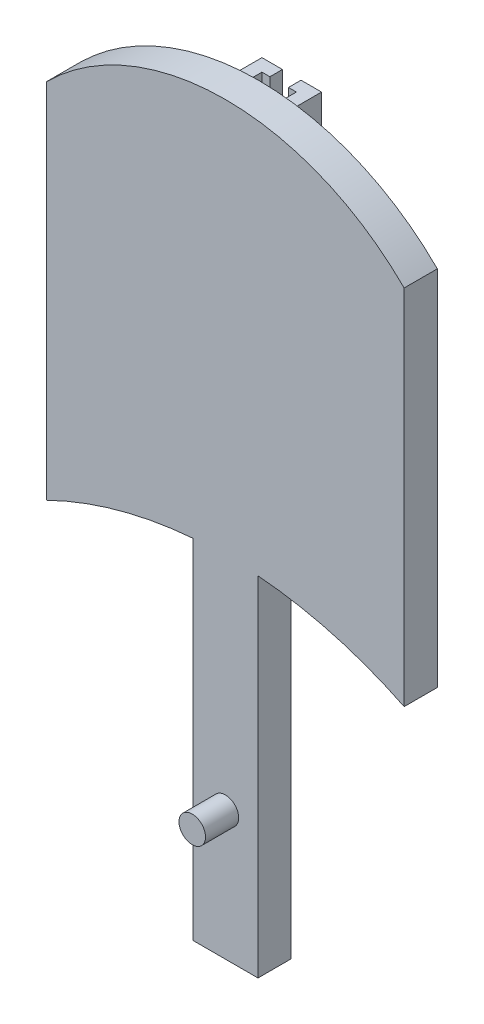
ISO-10303-21;
HEADER;
FILE_DESCRIPTION(('STEP AP214'),'2;1');
FILE_NAME('part.step','',(''),(''),'','','');
FILE_SCHEMA(('AUTOMOTIVE_DESIGN { 1 0 10303 214 1 1 1 1 }'));
ENDSEC;
DATA;
#1=APPLICATION_CONTEXT('core data for automotive mechanical design processes');
#2=APPLICATION_PROTOCOL_DEFINITION('international standard','automotive_design',2000,#1);
#3=PRODUCT_CONTEXT('',#1,'mechanical');
#4=PRODUCT('Part','Part','',(#3));
#5=PRODUCT_RELATED_PRODUCT_CATEGORY('part','',(#4));
#6=PRODUCT_DEFINITION_FORMATION('','',#4);
#7=PRODUCT_DEFINITION_CONTEXT('part definition',#1,'design');
#8=PRODUCT_DEFINITION('design','',#6,#7);
#9=PRODUCT_DEFINITION_SHAPE('','',#8);
#10=(LENGTH_UNIT() NAMED_UNIT(*) SI_UNIT(.MILLI.,.METRE.));
#11=(NAMED_UNIT(*) PLANE_ANGLE_UNIT() SI_UNIT($,.RADIAN.));
#12=(NAMED_UNIT(*) SI_UNIT($,.STERADIAN.) SOLID_ANGLE_UNIT());
#13=UNCERTAINTY_MEASURE_WITH_UNIT(LENGTH_MEASURE(1.E-05),#10,'distance_accuracy_value','');
#14=(GEOMETRIC_REPRESENTATION_CONTEXT(3) GLOBAL_UNCERTAINTY_ASSIGNED_CONTEXT((#13)) GLOBAL_UNIT_ASSIGNED_CONTEXT((#10,
#11,#12)) REPRESENTATION_CONTEXT('',''));
#15=CARTESIAN_POINT('',(0.,0.,0.));
#16=DIRECTION('',(0.,0.,1.));
#17=DIRECTION('',(1.,0.,0.));
#18=AXIS2_PLACEMENT_3D('',#15,#16,#17);
#19=CARTESIAN_POINT('',(0.,23.2983529403055,-3.175));
#20=DIRECTION('',(0.,1.,0.));
#21=DIRECTION('',(0.,0.,1.));
#22=AXIS2_PLACEMENT_3D('',#19,#20,#21);
#23=PLANE('',#22);
#24=DIRECTION('',(0.,0.,-1.));
#25=VECTOR('',#24,1.);
#26=CARTESIAN_POINT('',(0.888999999999995,23.2983529403055,6.351));
#27=LINE('',#26,#25);
#28=CARTESIAN_POINT('',(0.888999999999995,23.2983529403055,-1.972861942));
#29=VERTEX_POINT('',#28);
#30=CARTESIAN_POINT('',(0.888999999999995,23.2983529403055,-3.175));
#31=VERTEX_POINT('',#30);
#32=EDGE_CURVE('E452',#29,#31,#27,.T.);
#33=ORIENTED_EDGE('',*,*,#32,.F.);
#34=DIRECTION('',(1.,0.,0.));
#35=VECTOR('',#34,1.);
#36=CARTESIAN_POINT('',(-17.1162533328683,23.2983529403055,-1.972861942));
#37=LINE('',#36,#35);
#38=CARTESIAN_POINT('',(1.65128861988301,23.2983529403055,-1.972861942));
#39=VERTEX_POINT('',#38);
#40=EDGE_CURVE('E216',#29,#39,#37,.T.);
#41=ORIENTED_EDGE('',*,*,#40,.T.);
#42=DIRECTION('',(0.,0.,1.));
#43=VECTOR('',#42,1.);
#44=CARTESIAN_POINT('',(1.65128861988301,23.2983529403055,-3.175));
#45=LINE('',#44,#43);
#46=CARTESIAN_POINT('',(1.65128861988301,23.2983529403055,0.));
#47=VERTEX_POINT('',#46);
#48=EDGE_CURVE('E312',#39,#47,#45,.T.);
#49=ORIENTED_EDGE('',*,*,#48,.T.);
#50=DIRECTION('',(-1.,0.,0.));
#51=VECTOR('',#50,1.);
#52=CARTESIAN_POINT('',(0.,23.2983529403055,0.));
#53=LINE('',#52,#51);
#54=CARTESIAN_POINT('',(2.85342673515783,23.2983529403055,0.));
#55=VERTEX_POINT('',#54);
#56=EDGE_CURVE('E292',#55,#47,#53,.T.);
#57=ORIENTED_EDGE('',*,*,#56,.F.);
#58=DIRECTION('',(0.,0.,1.));
#59=VECTOR('',#58,1.);
#60=CARTESIAN_POINT('',(2.85342673515783,23.2983529403055,-3.175));
#61=LINE('',#60,#59);
#62=CARTESIAN_POINT('',(2.85342673515783,23.2983529403055,-3.175));
#63=VERTEX_POINT('',#62);
#64=EDGE_CURVE('E308',#63,#55,#61,.T.);
#65=ORIENTED_EDGE('',*,*,#64,.F.);
#66=DIRECTION('',(-1.,0.,0.));
#67=VECTOR('',#66,1.);
#68=CARTESIAN_POINT('',(0.,23.2983529403055,-3.175));
#69=LINE('',#68,#67);
#70=EDGE_CURVE('E274',#63,#31,#69,.T.);
#71=ORIENTED_EDGE('',*,*,#70,.T.);
#72=EDGE_LOOP('',(#33,#41,#49,#57,#65,#71));
#73=FACE_BOUND('',#72,.T.);
#74=ADVANCED_FACE('F47',(#73),#23,.T.);
#75=CARTESIAN_POINT('',(0.,0.,-3.175));
#76=DIRECTION('',(0.,0.,-1.));
#77=DIRECTION('',(-1.,0.,0.));
#78=AXIS2_PLACEMENT_3D('',#75,#76,#77);
#79=PLANE('',#78);
#80=DIRECTION('',(0.,-1.,0.));
#81=VECTOR('',#80,1.);
#82=CARTESIAN_POINT('',(0.888999999999995,-13.4179283025949,-3.175));
#83=LINE('',#82,#81);
#84=CARTESIAN_POINT('',(0.888999999999987,-13.4179283025949,-3.175));
#85=VERTEX_POINT('',#84);
#86=EDGE_CURVE('E71',#31,#85,#83,.T.);
#87=ORIENTED_EDGE('',*,*,#86,.F.);
#88=ORIENTED_EDGE('',*,*,#70,.F.);
#89=DIRECTION('',(0.,1.,0.));
#90=VECTOR('',#89,1.);
#91=CARTESIAN_POINT('',(2.85342673515783,0.,-3.175));
#92=LINE('',#91,#90);
#93=CARTESIAN_POINT('',(2.85342673515783,-13.4877816695383,-3.175));
#94=VERTEX_POINT('',#93);
#95=EDGE_CURVE('E278',#94,#63,#92,.T.);
#96=ORIENTED_EDGE('',*,*,#95,.F.);
#97=CARTESIAN_POINT('',(0.,-52.2146947063219,-3.175));
#98=DIRECTION('',(0.,0.,-1.));
#99=DIRECTION('',(-1.,0.,0.));
#100=AXIS2_PLACEMENT_3D('',#97,#98,#99);
#101=CIRCLE('',#100,38.8318920153463);
#102=CARTESIAN_POINT('',(1.65128861988301,-13.4179283025949,-3.175));
#103=VERTEX_POINT('',#102);
#104=EDGE_CURVE('E283',#94,#103,#101,.F.);
#105=ORIENTED_EDGE('',*,*,#104,.T.);
#106=DIRECTION('',(1.,0.,0.));
#107=VECTOR('',#106,1.);
#108=CARTESIAN_POINT('',(-17.1162533328683,-13.4179283025949,-3.175));
#109=LINE('',#108,#107);
#110=EDGE_CURVE('E446',#85,#103,#109,.T.);
#111=ORIENTED_EDGE('',*,*,#110,.F.);
#112=EDGE_LOOP('',(#87,#88,#96,#105,#111));
#113=FACE_BOUND('',#112,.T.);
#114=ADVANCED_FACE('F451',(#113),#79,.T.);
#115=CARTESIAN_POINT('',(-17.1162533328683,23.2983529403055,-1.972861942));
#116=DIRECTION('',(0.,0.,-1.));
#117=DIRECTION('',(-1.,0.,0.));
#118=AXIS2_PLACEMENT_3D('',#115,#116,#117);
#119=PLANE('',#118);
#120=ORIENTED_EDGE('',*,*,#40,.F.);
#121=DIRECTION('',(0.,1.,0.));
#122=VECTOR('',#121,1.);
#123=CARTESIAN_POINT('',(0.888999999999995,-13.4179283025949,-1.972861942));
#124=LINE('',#123,#122);
#125=CARTESIAN_POINT('',(0.888999999999995,-13.4179283025949,-1.972861942));
#126=VERTEX_POINT('',#125);
#127=EDGE_CURVE('E208',#126,#29,#124,.T.);
#128=ORIENTED_EDGE('',*,*,#127,.F.);
#129=DIRECTION('',(1.,0.,0.));
#130=VECTOR('',#129,1.);
#131=CARTESIAN_POINT('',(-17.1162533328683,-13.4179283025949,-1.972861942));
#132=LINE('',#131,#130);
#133=CARTESIAN_POINT('',(1.65128861988301,-13.4179283025949,-1.972861942));
#134=VERTEX_POINT('',#133);
#135=EDGE_CURVE('E444',#126,#134,#132,.T.);
#136=ORIENTED_EDGE('',*,*,#135,.T.);
#137=DIRECTION('',(0.,1.,0.));
#138=VECTOR('',#137,1.);
#139=CARTESIAN_POINT('',(1.65128861988301,23.2983529403055,-1.972861942));
#140=LINE('',#139,#138);
#141=EDGE_CURVE('E215',#134,#39,#140,.T.);
#142=ORIENTED_EDGE('',*,*,#141,.T.);
#143=EDGE_LOOP('',(#120,#128,#136,#142));
#144=FACE_BOUND('',#143,.T.);
#145=ADVANCED_FACE('F457',(#144),#119,.F.);
#146=CARTESIAN_POINT('',(-17.1162533328683,-13.4179283025949,-1.972861942));
#147=DIRECTION('',(0.,1.,0.));
#148=DIRECTION('',(0.,0.,1.));
#149=AXIS2_PLACEMENT_3D('',#146,#147,#148);
#150=PLANE('',#149);
#151=ORIENTED_EDGE('',*,*,#135,.F.);
#152=DIRECTION('',(0.,0.,-1.));
#153=VECTOR('',#152,1.);
#154=CARTESIAN_POINT('',(0.888999999999995,-13.4179283025949,6.351));
#155=LINE('',#154,#153);
#156=EDGE_CURVE('E447',#126,#85,#155,.T.);
#157=ORIENTED_EDGE('',*,*,#156,.T.);
#158=ORIENTED_EDGE('',*,*,#110,.T.);
#159=DIRECTION('',(0.,0.,1.));
#160=VECTOR('',#159,1.);
#161=CARTESIAN_POINT('',(1.65128861988301,-13.4179283025949,-3.175));
#162=LINE('',#161,#160);
#163=EDGE_CURVE('E300',#103,#134,#162,.T.);
#164=ORIENTED_EDGE('',*,*,#163,.T.);
#165=EDGE_LOOP('',(#151,#157,#158,#164));
#166=FACE_BOUND('',#165,.T.);
#167=ADVANCED_FACE('F443',(#166),#150,.F.);
#168=CARTESIAN_POINT('',(-1.65128861988301,0.,-3.175));
#169=DIRECTION('',(1.,0.,0.));
#170=DIRECTION('',(0.,0.,-1.));
#171=AXIS2_PLACEMENT_3D('',#168,#169,#170);
#172=PLANE('',#171);
#173=DIRECTION('',(0.,0.,1.));
#174=VECTOR('',#173,1.);
#175=CARTESIAN_POINT('',(-1.65128861988301,-13.4179283025949,-3.175));
#176=LINE('',#175,#174);
#177=CARTESIAN_POINT('',(-1.65128861988301,-13.4179283025949,-1.972861942));
#178=VERTEX_POINT('',#177);
#179=CARTESIAN_POINT('',(-1.65128861988301,-13.4179283025949,0.));
#180=VERTEX_POINT('',#179);
#181=EDGE_CURVE('E325',#178,#180,#176,.T.);
#182=ORIENTED_EDGE('',*,*,#181,.F.);
#183=DIRECTION('',(0.,-1.,0.));
#184=VECTOR('',#183,1.);
#185=CARTESIAN_POINT('',(-1.65128861988301,23.2983529403055,-1.972861942));
#186=LINE('',#185,#184);
#187=CARTESIAN_POINT('',(-1.65128861988301,23.2983529403055,-1.972861942));
#188=VERTEX_POINT('',#187);
#189=EDGE_CURVE('E196',#188,#178,#186,.T.);
#190=ORIENTED_EDGE('',*,*,#189,.F.);
#191=DIRECTION('',(0.,0.,1.));
#192=VECTOR('',#191,1.);
#193=CARTESIAN_POINT('',(-1.65128861988301,23.2983529403055,-3.175));
#194=LINE('',#193,#192);
#195=CARTESIAN_POINT('',(-1.65128861988301,23.2983529403055,0.));
#196=VERTEX_POINT('',#195);
#197=EDGE_CURVE('E213',#188,#196,#194,.T.);
#198=ORIENTED_EDGE('',*,*,#197,.T.);
#199=DIRECTION('',(0.,1.,0.));
#200=VECTOR('',#199,1.);
#201=CARTESIAN_POINT('',(-1.65128861988301,0.,0.));
#202=LINE('',#201,#200);
#203=EDGE_CURVE('E321',#180,#196,#202,.T.);
#204=ORIENTED_EDGE('',*,*,#203,.F.);
#205=EDGE_LOOP('',(#182,#190,#198,#204));
#206=FACE_BOUND('',#205,.T.);
#207=ADVANCED_FACE('F514',(#206),#172,.T.);
#208=CARTESIAN_POINT('',(1.65128861988301,0.,-3.175));
#209=DIRECTION('',(1.,0.,0.));
#210=DIRECTION('',(0.,0.,-1.));
#211=AXIS2_PLACEMENT_3D('',#208,#209,#210);
#212=PLANE('',#211);
#213=ORIENTED_EDGE('',*,*,#141,.F.);
#214=CARTESIAN_POINT('',(1.65128861988301,-13.4179283025949,0.));
#215=VERTEX_POINT('',#214);
#216=EDGE_CURVE('E287',#134,#215,#162,.T.);
#217=ORIENTED_EDGE('',*,*,#216,.T.);
#218=DIRECTION('',(0.,1.,0.));
#219=VECTOR('',#218,1.);
#220=CARTESIAN_POINT('',(1.65128861988301,0.,0.));
#221=LINE('',#220,#219);
#222=EDGE_CURVE('E288',#215,#47,#221,.T.);
#223=ORIENTED_EDGE('',*,*,#222,.T.);
#224=ORIENTED_EDGE('',*,*,#48,.F.);
#225=EDGE_LOOP('',(#213,#217,#223,#224));
#226=FACE_BOUND('',#225,.T.);
#227=ADVANCED_FACE('F440',(#226),#212,.F.);
#228=CARTESIAN_POINT('',(0.,-52.2146947063219,3.175));
#229=DIRECTION('',(0.,0.,-1.));
#230=DIRECTION('',(-1.,0.,0.));
#231=AXIS2_PLACEMENT_3D('',#228,#229,#230);
#232=CYLINDRICAL_SURFACE('',#231,38.8318920153463);
#233=CARTESIAN_POINT('',(0.,-52.2146947063219,3.175));
#234=DIRECTION('',(0.,0.,1.));
#235=DIRECTION('',(1.,0.,0.));
#236=AXIS2_PLACEMENT_3D('',#233,#234,#235);
#237=CIRCLE('',#236,38.8318920153463);
#238=CARTESIAN_POINT('',(3.11847985069034,-13.5082234009658,3.175));
#239=VERTEX_POINT('',#238);
#240=CARTESIAN_POINT('',(17.1142533328683,-17.3575839489754,3.175));
#241=VERTEX_POINT('',#240);
#242=EDGE_CURVE('E357',#239,#241,#237,.F.);
#243=ORIENTED_EDGE('',*,*,#242,.F.);
#244=DIRECTION('',(0.,0.,-1.));
#245=VECTOR('',#244,1.);
#246=CARTESIAN_POINT('',(3.11847985069034,-13.5082234009658,3.175));
#247=LINE('',#246,#245);
#248=CARTESIAN_POINT('',(3.11847985069034,-13.5082234009658,0.));
#249=VERTEX_POINT('',#248);
#250=EDGE_CURVE('E269',#239,#249,#247,.T.);
#251=ORIENTED_EDGE('',*,*,#250,.T.);
#252=CARTESIAN_POINT('',(0.,-52.2146947063219,0.));
#253=DIRECTION('',(0.,0.,1.));
#254=DIRECTION('',(1.,0.,0.));
#255=AXIS2_PLACEMENT_3D('',#252,#253,#254);
#256=CIRCLE('',#255,38.8318920153463);
#257=CARTESIAN_POINT('',(17.1142533328683,-17.3575839489754,0.));
#258=VERTEX_POINT('',#257);
#259=EDGE_CURVE('E373',#249,#258,#256,.F.);
#260=ORIENTED_EDGE('',*,*,#259,.T.);
#261=DIRECTION('',(0.,0.,-1.));
#262=VECTOR('',#261,1.);
#263=CARTESIAN_POINT('',(17.1142533328683,-17.3575839489754,3.175));
#264=LINE('',#263,#262);
#265=EDGE_CURVE('E383',#241,#258,#264,.T.);
#266=ORIENTED_EDGE('',*,*,#265,.F.);
#267=EDGE_LOOP('',(#243,#251,#260,#266));
#268=FACE_BOUND('',#267,.T.);
#269=ADVANCED_FACE('F413',(#268),#232,.F.);
#270=CARTESIAN_POINT('',(0.,-52.2146947063219,0.));
#271=DIRECTION('',(0.,0.,1.));
#272=DIRECTION('',(1.,0.,0.));
#273=AXIS2_PLACEMENT_3D('',#270,#271,#272);
#274=CIRCLE('',#273,38.8318920153463);
#275=CARTESIAN_POINT('',(-2.85342673515783,-13.4877816695383,0.));
#276=VERTEX_POINT('',#275);
#277=EDGE_CURVE('E261',#276,#180,#274,.F.);
#278=ORIENTED_EDGE('',*,*,#277,.F.);
#279=DIRECTION('',(0.,0.,1.));
#280=VECTOR('',#279,1.);
#281=CARTESIAN_POINT('',(-2.85342673515783,-13.4877816695383,-3.175));
#282=LINE('',#281,#280);
#283=CARTESIAN_POINT('',(-2.85342673515783,-13.4877816695383,-3.175));
#284=VERTEX_POINT('',#283);
#285=EDGE_CURVE('E293',#284,#276,#282,.T.);
#286=ORIENTED_EDGE('',*,*,#285,.F.);
#287=CARTESIAN_POINT('',(0.,-52.2146947063219,-3.175));
#288=DIRECTION('',(0.,0.,-1.));
#289=DIRECTION('',(-1.,0.,0.));
#290=AXIS2_PLACEMENT_3D('',#287,#288,#289);
#291=CIRCLE('',#290,38.8318920153463);
#292=CARTESIAN_POINT('',(-1.65128861988301,-13.4179283025949,-3.175));
#293=VERTEX_POINT('',#292);
#294=EDGE_CURVE('E316',#293,#284,#291,.F.);
#295=ORIENTED_EDGE('',*,*,#294,.F.);
#296=EDGE_CURVE('E335',#293,#178,#176,.T.);
#297=ORIENTED_EDGE('',*,*,#296,.T.);
#298=ORIENTED_EDGE('',*,*,#181,.T.);
#299=EDGE_LOOP('',(#278,#286,#295,#297,#298));
#300=FACE_BOUND('',#299,.T.);
#301=ADVANCED_FACE('F603',(#300),#232,.F.);
#302=CARTESIAN_POINT('',(2.85342673515783,-13.4877816695383,0.));
#303=VERTEX_POINT('',#302);
#304=EDGE_CURVE('E257',#215,#303,#274,.F.);
#305=ORIENTED_EDGE('',*,*,#304,.F.);
#306=ORIENTED_EDGE('',*,*,#216,.F.);
#307=ORIENTED_EDGE('',*,*,#163,.F.);
#308=ORIENTED_EDGE('',*,*,#104,.F.);
#309=DIRECTION('',(0.,0.,1.));
#310=VECTOR('',#309,1.);
#311=CARTESIAN_POINT('',(2.85342673515783,-13.4877816695383,-3.175));
#312=LINE('',#311,#310);
#313=EDGE_CURVE('E304',#94,#303,#312,.T.);
#314=ORIENTED_EDGE('',*,*,#313,.T.);
#315=EDGE_LOOP('',(#305,#306,#307,#308,#314));
#316=FACE_BOUND('',#315,.T.);
#317=ADVANCED_FACE('F427',(#316),#232,.F.);
#318=CARTESIAN_POINT('',(0.,0.,0.));
#319=DIRECTION('',(0.,0.,1.));
#320=DIRECTION('',(1.,0.,0.));
#321=AXIS2_PLACEMENT_3D('',#318,#319,#320);
#322=PLANE('',#321);
#323=DIRECTION('',(0.,-1.,0.));
#324=VECTOR('',#323,1.);
#325=CARTESIAN_POINT('',(-3.11847985069032,0.338888516574702,0.));
#326=LINE('',#325,#324);
#327=CARTESIAN_POINT('',(-3.11847985069032,-13.5082234009658,0.));
#328=VERTEX_POINT('',#327);
#329=CARTESIAN_POINT('',(-3.11847985069032,-46.8558230045354,0.));
#330=VERTEX_POINT('',#329);
#331=EDGE_CURVE('E237',#328,#330,#326,.T.);
#332=ORIENTED_EDGE('',*,*,#331,.F.);
#333=CARTESIAN_POINT('',(-17.1142533328683,-17.3575839489754,0.));
#334=VERTEX_POINT('',#333);
#335=EDGE_CURVE('E374',#334,#328,#256,.F.);
#336=ORIENTED_EDGE('',*,*,#335,.F.);
#337=DIRECTION('',(0.,1.,0.));
#338=VECTOR('',#337,1.);
#339=CARTESIAN_POINT('',(-17.1142533328683,0.,0.));
#340=LINE('',#339,#338);
#341=CARTESIAN_POINT('',(-17.1142533328683,17.3575839489754,0.));
#342=VERTEX_POINT('',#341);
#343=EDGE_CURVE('E369',#334,#342,#340,.T.);
#344=ORIENTED_EDGE('',*,*,#343,.T.);
#345=CARTESIAN_POINT('',(0.,0.194287236116569,0.));
#346=DIRECTION('',(0.,0.,1.));
#347=DIRECTION('',(1.,0.,0.));
#348=AXIS2_PLACEMENT_3D('',#345,#346,#347);
#349=CIRCLE('',#348,24.2379128885971);
#350=CARTESIAN_POINT('',(17.1142533328683,17.3575839489754,0.));
#351=VERTEX_POINT('',#350);
#352=EDGE_CURVE('E315',#342,#351,#349,.F.);
#353=ORIENTED_EDGE('',*,*,#352,.T.);
#354=DIRECTION('',(0.,1.,0.));
#355=VECTOR('',#354,1.);
#356=CARTESIAN_POINT('',(17.1142533328683,0.,0.));
#357=LINE('',#356,#355);
#358=EDGE_CURVE('E353',#258,#351,#357,.T.);
#359=ORIENTED_EDGE('',*,*,#358,.F.);
#360=ORIENTED_EDGE('',*,*,#259,.F.);
#361=DIRECTION('',(0.,1.,0.));
#362=VECTOR('',#361,1.);
#363=CARTESIAN_POINT('',(3.11847985069032,0.338888516574709,0.));
#364=LINE('',#363,#362);
#365=CARTESIAN_POINT('',(3.1184798506904,-46.8558230045354,0.));
#366=VERTEX_POINT('',#365);
#367=EDGE_CURVE('E234',#366,#249,#364,.T.);
#368=ORIENTED_EDGE('',*,*,#367,.F.);
#369=DIRECTION('',(1.,0.,0.));
#370=VECTOR('',#369,1.);
#371=CARTESIAN_POINT('',(-3.11847985069032,-46.8558230045354,0.));
#372=LINE('',#371,#370);
#373=EDGE_CURVE('E241',#330,#366,#372,.T.);
#374=ORIENTED_EDGE('',*,*,#373,.F.);
#375=EDGE_LOOP('',(#332,#336,#344,#353,#359,#360,#368,#374));
#376=FACE_BOUND('',#375,.T.);
#377=DIRECTION('',(0.,1.,0.));
#378=VECTOR('',#377,1.);
#379=CARTESIAN_POINT('',(2.85342673515783,0.,0.));
#380=LINE('',#379,#378);
#381=EDGE_CURVE('E297',#303,#55,#380,.T.);
#382=ORIENTED_EDGE('',*,*,#381,.T.);
#383=ORIENTED_EDGE('',*,*,#56,.T.);
#384=ORIENTED_EDGE('',*,*,#222,.F.);
#385=ORIENTED_EDGE('',*,*,#304,.T.);
#386=EDGE_LOOP('',(#382,#383,#384,#385));
#387=FACE_BOUND('',#386,.T.);
#388=ORIENTED_EDGE('',*,*,#203,.T.);
#389=DIRECTION('',(-1.,0.,0.));
#390=VECTOR('',#389,1.);
#391=CARTESIAN_POINT('',(0.,23.2983529403055,0.));
#392=LINE('',#391,#390);
#393=CARTESIAN_POINT('',(-2.85342673515783,23.2983529403055,0.));
#394=VERTEX_POINT('',#393);
#395=EDGE_CURVE('E328',#196,#394,#392,.T.);
#396=ORIENTED_EDGE('',*,*,#395,.T.);
#397=DIRECTION('',(0.,1.,0.));
#398=VECTOR('',#397,1.);
#399=CARTESIAN_POINT('',(-2.85342673515783,0.,0.));
#400=LINE('',#399,#398);
#401=EDGE_CURVE('E273',#276,#394,#400,.T.);
#402=ORIENTED_EDGE('',*,*,#401,.F.);
#403=ORIENTED_EDGE('',*,*,#277,.T.);
#404=EDGE_LOOP('',(#388,#396,#402,#403));
#405=FACE_BOUND('',#404,.T.);
#406=ADVANCED_FACE('F396',(#376,#387,#405),#322,.F.);
#407=CARTESIAN_POINT('',(0.,0.194287236116569,3.175));
#408=DIRECTION('',(0.,0.,-1.));
#409=DIRECTION('',(-1.,0.,0.));
#410=AXIS2_PLACEMENT_3D('',#407,#408,#409);
#411=CYLINDRICAL_SURFACE('',#410,24.2379128885971);
#412=ORIENTED_EDGE('',*,*,#352,.F.);
#413=DIRECTION('',(0.,0.,-1.));
#414=VECTOR('',#413,1.);
#415=CARTESIAN_POINT('',(-17.1142533328683,17.3575839489754,3.175));
#416=LINE('',#415,#414);
#417=CARTESIAN_POINT('',(-17.1142533328683,17.3575839489754,3.175));
#418=VERTEX_POINT('',#417);
#419=EDGE_CURVE('E11',#418,#342,#416,.T.);
#420=ORIENTED_EDGE('',*,*,#419,.F.);
#421=CARTESIAN_POINT('',(0.,0.194287236116569,3.175));
#422=DIRECTION('',(0.,0.,1.));
#423=DIRECTION('',(1.,0.,0.));
#424=AXIS2_PLACEMENT_3D('',#421,#422,#423);
#425=CIRCLE('',#424,24.2379128885971);
#426=CARTESIAN_POINT('',(17.1142533328683,17.3575839489754,3.175));
#427=VERTEX_POINT('',#426);
#428=EDGE_CURVE('E348',#418,#427,#425,.F.);
#429=ORIENTED_EDGE('',*,*,#428,.T.);
#430=DIRECTION('',(0.,0.,-1.));
#431=VECTOR('',#430,1.);
#432=CARTESIAN_POINT('',(17.1142533328683,17.3575839489754,3.175));
#433=LINE('',#432,#431);
#434=EDGE_CURVE('E365',#427,#351,#433,.T.);
#435=ORIENTED_EDGE('',*,*,#434,.T.);
#436=EDGE_LOOP('',(#412,#420,#429,#435));
#437=FACE_BOUND('',#436,.T.);
#438=ADVANCED_FACE('F49',(#437),#411,.T.);
#439=CARTESIAN_POINT('',(-17.1142533328683,0.,3.175));
#440=DIRECTION('',(-1.,0.,0.));
#441=DIRECTION('',(0.,0.,1.));
#442=AXIS2_PLACEMENT_3D('',#439,#440,#441);
#443=PLANE('',#442);
#444=ORIENTED_EDGE('',*,*,#343,.F.);
#445=DIRECTION('',(0.,0.,-1.));
#446=VECTOR('',#445,1.);
#447=CARTESIAN_POINT('',(-17.1142533328683,-17.3575839489754,3.175));
#448=LINE('',#447,#446);
#449=CARTESIAN_POINT('',(-17.1142533328683,-17.3575839489754,3.175));
#450=VERTEX_POINT('',#449);
#451=EDGE_CURVE('E56',#450,#334,#448,.T.);
#452=ORIENTED_EDGE('',*,*,#451,.F.);
#453=DIRECTION('',(0.,1.,0.));
#454=VECTOR('',#453,1.);
#455=CARTESIAN_POINT('',(-17.1142533328683,0.,3.175));
#456=LINE('',#455,#454);
#457=EDGE_CURVE('E352',#450,#418,#456,.T.);
#458=ORIENTED_EDGE('',*,*,#457,.T.);
#459=ORIENTED_EDGE('',*,*,#419,.T.);
#460=EDGE_LOOP('',(#444,#452,#458,#459));
#461=FACE_BOUND('',#460,.T.);
#462=ADVANCED_FACE('F399',(#461),#443,.T.);
#463=ORIENTED_EDGE('',*,*,#335,.T.);
#464=DIRECTION('',(0.,0.,-1.));
#465=VECTOR('',#464,1.);
#466=CARTESIAN_POINT('',(-3.11847985069032,-13.5082234009658,3.175));
#467=LINE('',#466,#465);
#468=CARTESIAN_POINT('',(-3.11847985069032,-13.5082234009658,3.175));
#469=VERTEX_POINT('',#468);
#470=EDGE_CURVE('E265',#328,#469,#467,.F.);
#471=ORIENTED_EDGE('',*,*,#470,.T.);
#472=EDGE_CURVE('E358',#450,#469,#237,.F.);
#473=ORIENTED_EDGE('',*,*,#472,.F.);
#474=ORIENTED_EDGE('',*,*,#451,.T.);
#475=EDGE_LOOP('',(#463,#471,#473,#474));
#476=FACE_BOUND('',#475,.T.);
#477=ADVANCED_FACE('F390',(#476),#232,.F.);
#478=CARTESIAN_POINT('',(17.1142533328683,0.,3.175));
#479=DIRECTION('',(-1.,0.,0.));
#480=DIRECTION('',(0.,0.,1.));
#481=AXIS2_PLACEMENT_3D('',#478,#479,#480);
#482=PLANE('',#481);
#483=ORIENTED_EDGE('',*,*,#358,.T.);
#484=ORIENTED_EDGE('',*,*,#434,.F.);
#485=DIRECTION('',(0.,1.,0.));
#486=VECTOR('',#485,1.);
#487=CARTESIAN_POINT('',(17.1142533328683,0.,3.175));
#488=LINE('',#487,#486);
#489=EDGE_CURVE('E362',#241,#427,#488,.T.);
#490=ORIENTED_EDGE('',*,*,#489,.F.);
#491=ORIENTED_EDGE('',*,*,#265,.T.);
#492=EDGE_LOOP('',(#483,#484,#490,#491));
#493=FACE_BOUND('',#492,.T.);
#494=ADVANCED_FACE('F408',(#493),#482,.F.);
#495=CARTESIAN_POINT('',(0.,0.,3.175));
#496=DIRECTION('',(0.,0.,1.));
#497=DIRECTION('',(1.,0.,0.));
#498=AXIS2_PLACEMENT_3D('',#495,#496,#497);
#499=PLANE('',#498);
#500=CARTESIAN_POINT('',(0.,-34.5036834153857,3.175));
#501=DIRECTION('',(0.,0.,1.));
#502=DIRECTION('',(1.,0.,0.));
#503=AXIS2_PLACEMENT_3D('',#500,#501,#502);
#504=CIRCLE('',#503,1.27);
#505=CARTESIAN_POINT('',(1.27,-34.5036834153857,3.175));
#506=VERTEX_POINT('',#505);
#507=EDGE_CURVE('E221',#506,#506,#504,.T.);
#508=ORIENTED_EDGE('',*,*,#507,.F.);
#509=EDGE_LOOP('',(#508));
#510=FACE_BOUND('',#509,.T.);
#511=ORIENTED_EDGE('',*,*,#472,.T.);
#512=DIRECTION('',(0.,-1.,0.));
#513=VECTOR('',#512,1.);
#514=CARTESIAN_POINT('',(-3.11847985069032,0.338888516574702,3.175));
#515=LINE('',#514,#513);
#516=CARTESIAN_POINT('',(-3.11847985069032,-46.8558230045354,3.175));
#517=VERTEX_POINT('',#516);
#518=EDGE_CURVE('E248',#469,#517,#515,.T.);
#519=ORIENTED_EDGE('',*,*,#518,.T.);
#520=DIRECTION('',(1.,0.,0.));
#521=VECTOR('',#520,1.);
#522=CARTESIAN_POINT('',(-3.11847985069032,-46.8558230045354,3.175));
#523=LINE('',#522,#521);
#524=CARTESIAN_POINT('',(3.1184798506904,-46.8558230045354,3.175));
#525=VERTEX_POINT('',#524);
#526=EDGE_CURVE('E238',#517,#525,#523,.T.);
#527=ORIENTED_EDGE('',*,*,#526,.T.);
#528=DIRECTION('',(0.,1.,0.));
#529=VECTOR('',#528,1.);
#530=CARTESIAN_POINT('',(3.11847985069032,0.338888516574709,3.175));
#531=LINE('',#530,#529);
#532=EDGE_CURVE('E230',#525,#239,#531,.T.);
#533=ORIENTED_EDGE('',*,*,#532,.T.);
#534=ORIENTED_EDGE('',*,*,#242,.T.);
#535=ORIENTED_EDGE('',*,*,#489,.T.);
#536=ORIENTED_EDGE('',*,*,#428,.F.);
#537=ORIENTED_EDGE('',*,*,#457,.F.);
#538=EDGE_LOOP('',(#511,#519,#527,#533,#534,#535,#536,#537));
#539=FACE_BOUND('',#538,.T.);
#540=ADVANCED_FACE('F504',(#510,#539),#499,.T.);
#541=CARTESIAN_POINT('',(-2.85342673515783,0.,-3.175));
#542=DIRECTION('',(1.,0.,0.));
#543=DIRECTION('',(0.,0.,-1.));
#544=AXIS2_PLACEMENT_3D('',#541,#542,#543);
#545=PLANE('',#544);
#546=ORIENTED_EDGE('',*,*,#401,.T.);
#547=DIRECTION('',(0.,0.,1.));
#548=VECTOR('',#547,1.);
#549=CARTESIAN_POINT('',(-2.85342673515783,23.2983529403055,-3.175));
#550=LINE('',#549,#548);
#551=CARTESIAN_POINT('',(-2.85342673515783,23.2983529403055,-3.175));
#552=VERTEX_POINT('',#551);
#553=EDGE_CURVE('E341',#552,#394,#550,.T.);
#554=ORIENTED_EDGE('',*,*,#553,.F.);
#555=DIRECTION('',(0.,1.,0.));
#556=VECTOR('',#555,1.);
#557=CARTESIAN_POINT('',(-2.85342673515783,0.,-3.175));
#558=LINE('',#557,#556);
#559=EDGE_CURVE('E320',#284,#552,#558,.T.);
#560=ORIENTED_EDGE('',*,*,#559,.F.);
#561=ORIENTED_EDGE('',*,*,#285,.T.);
#562=EDGE_LOOP('',(#546,#554,#560,#561));
#563=FACE_BOUND('',#562,.T.);
#564=ADVANCED_FACE('F497',(#563),#545,.F.);
#565=DIRECTION('',(0.,0.,-1.));
#566=VECTOR('',#565,1.);
#567=CARTESIAN_POINT('',(-0.889,23.2983529403055,6.351));
#568=LINE('',#567,#566);
#569=CARTESIAN_POINT('',(-0.889000000000008,23.2983529403055,-1.972861942));
#570=VERTEX_POINT('',#569);
#571=CARTESIAN_POINT('',(-0.889,23.2983529403055,-3.175));
#572=VERTEX_POINT('',#571);
#573=EDGE_CURVE('E188',#570,#572,#568,.T.);
#574=ORIENTED_EDGE('',*,*,#573,.T.);
#575=EDGE_CURVE('E279',#572,#552,#69,.T.);
#576=ORIENTED_EDGE('',*,*,#575,.T.);
#577=ORIENTED_EDGE('',*,*,#553,.T.);
#578=ORIENTED_EDGE('',*,*,#395,.F.);
#579=ORIENTED_EDGE('',*,*,#197,.F.);
#580=EDGE_CURVE('E204',#188,#570,#37,.T.);
#581=ORIENTED_EDGE('',*,*,#580,.T.);
#582=EDGE_LOOP('',(#574,#576,#577,#578,#579,#581));
#583=FACE_BOUND('',#582,.T.);
#584=ADVANCED_FACE('F211',(#583),#23,.T.);
#585=CARTESIAN_POINT('',(2.85342673515783,0.,-3.175));
#586=DIRECTION('',(1.,0.,0.));
#587=DIRECTION('',(0.,0.,-1.));
#588=AXIS2_PLACEMENT_3D('',#585,#586,#587);
#589=PLANE('',#588);
#590=ORIENTED_EDGE('',*,*,#381,.F.);
#591=ORIENTED_EDGE('',*,*,#313,.F.);
#592=ORIENTED_EDGE('',*,*,#95,.T.);
#593=ORIENTED_EDGE('',*,*,#64,.T.);
#594=EDGE_LOOP('',(#590,#591,#592,#593));
#595=FACE_BOUND('',#594,.T.);
#596=ADVANCED_FACE('F431',(#595),#589,.T.);
#597=DIRECTION('',(0.,1.,0.));
#598=VECTOR('',#597,1.);
#599=CARTESIAN_POINT('',(-0.889,23.2983529403055,-3.175));
#600=LINE('',#599,#598);
#601=CARTESIAN_POINT('',(-0.889000000000005,-13.4179283025949,-3.175));
#602=VERTEX_POINT('',#601);
#603=EDGE_CURVE('E191',#602,#572,#600,.T.);
#604=ORIENTED_EDGE('',*,*,#603,.F.);
#605=EDGE_CURVE('E450',#293,#602,#109,.T.);
#606=ORIENTED_EDGE('',*,*,#605,.F.);
#607=ORIENTED_EDGE('',*,*,#294,.T.);
#608=ORIENTED_EDGE('',*,*,#559,.T.);
#609=ORIENTED_EDGE('',*,*,#575,.F.);
#610=EDGE_LOOP('',(#604,#606,#607,#608,#609));
#611=FACE_BOUND('',#610,.T.);
#612=ADVANCED_FACE('F493',(#611),#79,.T.);
#613=CARTESIAN_POINT('',(3.11847985069032,0.338888516574709,0.));
#614=DIRECTION('',(1.,0.,0.));
#615=DIRECTION('',(0.,1.,0.));
#616=AXIS2_PLACEMENT_3D('',#613,#614,#615);
#617=PLANE('',#616);
#618=ORIENTED_EDGE('',*,*,#250,.F.);
#619=ORIENTED_EDGE('',*,*,#532,.F.);
#620=DIRECTION('',(0.,0.,1.));
#621=VECTOR('',#620,1.);
#622=CARTESIAN_POINT('',(3.1184798506904,-46.8558230045354,0.));
#623=LINE('',#622,#621);
#624=EDGE_CURVE('E254',#366,#525,#623,.T.);
#625=ORIENTED_EDGE('',*,*,#624,.F.);
#626=ORIENTED_EDGE('',*,*,#367,.T.);
#627=EDGE_LOOP('',(#618,#619,#625,#626));
#628=FACE_BOUND('',#627,.T.);
#629=ADVANCED_FACE('F594',(#628),#617,.T.);
#630=CARTESIAN_POINT('',(-3.11847985069032,0.338888516574702,0.));
#631=DIRECTION('',(-1.,0.,0.));
#632=DIRECTION('',(0.,0.,1.));
#633=AXIS2_PLACEMENT_3D('',#630,#631,#632);
#634=PLANE('',#633);
#635=ORIENTED_EDGE('',*,*,#470,.F.);
#636=ORIENTED_EDGE('',*,*,#331,.T.);
#637=DIRECTION('',(0.,0.,1.));
#638=VECTOR('',#637,1.);
#639=CARTESIAN_POINT('',(-3.11847985069032,-46.8558230045354,0.));
#640=LINE('',#639,#638);
#641=EDGE_CURVE('E245',#330,#517,#640,.T.);
#642=ORIENTED_EDGE('',*,*,#641,.T.);
#643=ORIENTED_EDGE('',*,*,#518,.F.);
#644=EDGE_LOOP('',(#635,#636,#642,#643));
#645=FACE_BOUND('',#644,.T.);
#646=ADVANCED_FACE('F629',(#645),#634,.T.);
#647=CARTESIAN_POINT('',(-3.11847985069032,-46.8558230045354,0.));
#648=DIRECTION('',(0.,-1.,0.));
#649=DIRECTION('',(0.,0.,-1.));
#650=AXIS2_PLACEMENT_3D('',#647,#648,#649);
#651=PLANE('',#650);
#652=ORIENTED_EDGE('',*,*,#526,.F.);
#653=ORIENTED_EDGE('',*,*,#641,.F.);
#654=ORIENTED_EDGE('',*,*,#373,.T.);
#655=ORIENTED_EDGE('',*,*,#624,.T.);
#656=EDGE_LOOP('',(#652,#653,#654,#655));
#657=FACE_BOUND('',#656,.T.);
#658=ADVANCED_FACE('F638',(#657),#651,.T.);
#659=CARTESIAN_POINT('',(0.,-34.5036834153857,6.35));
#660=DIRECTION('',(0.,0.,-1.));
#661=DIRECTION('',(-1.,0.,0.));
#662=AXIS2_PLACEMENT_3D('',#659,#660,#661);
#663=CYLINDRICAL_SURFACE('',#662,1.27);
#664=CARTESIAN_POINT('',(0.,-34.5036834153857,6.35));
#665=DIRECTION('',(0.,0.,1.));
#666=DIRECTION('',(1.,0.,0.));
#667=AXIS2_PLACEMENT_3D('',#664,#665,#666);
#668=CIRCLE('',#667,1.27);
#669=CARTESIAN_POINT('',(1.27,-34.5036834153857,6.35));
#670=VERTEX_POINT('',#669);
#671=EDGE_CURVE('E226',#670,#670,#668,.T.);
#672=ORIENTED_EDGE('',*,*,#671,.F.);
#673=EDGE_LOOP('',(#672));
#674=FACE_BOUND('',#673,.T.);
#675=ORIENTED_EDGE('',*,*,#507,.T.);
#676=EDGE_LOOP('',(#675));
#677=FACE_BOUND('',#676,.T.);
#678=ADVANCED_FACE('F647',(#674,#677),#663,.T.);
#679=CARTESIAN_POINT('',(0.,0.,6.35));
#680=DIRECTION('',(0.,0.,1.));
#681=DIRECTION('',(1.,0.,0.));
#682=AXIS2_PLACEMENT_3D('',#679,#680,#681);
#683=PLANE('',#682);
#684=ORIENTED_EDGE('',*,*,#671,.T.);
#685=EDGE_LOOP('',(#684));
#686=FACE_BOUND('',#685,.T.);
#687=ADVANCED_FACE('F656',(#686),#683,.T.);
#688=CARTESIAN_POINT('',(-0.889000000000011,-13.4179283025949,-1.972861942));
#689=VERTEX_POINT('',#688);
#690=EDGE_CURVE('E206',#178,#689,#132,.T.);
#691=ORIENTED_EDGE('',*,*,#690,.T.);
#692=DIRECTION('',(0.,-1.,0.));
#693=VECTOR('',#692,1.);
#694=CARTESIAN_POINT('',(-0.889,23.2983529403055,-1.972861942));
#695=LINE('',#694,#693);
#696=EDGE_CURVE('E63',#570,#689,#695,.T.);
#697=ORIENTED_EDGE('',*,*,#696,.F.);
#698=ORIENTED_EDGE('',*,*,#580,.F.);
#699=ORIENTED_EDGE('',*,*,#189,.T.);
#700=EDGE_LOOP('',(#691,#697,#698,#699));
#701=FACE_BOUND('',#700,.T.);
#702=ADVANCED_FACE('F202',(#701),#119,.F.);
#703=ORIENTED_EDGE('',*,*,#605,.T.);
#704=DIRECTION('',(0.,0.,-1.));
#705=VECTOR('',#704,1.);
#706=CARTESIAN_POINT('',(-0.889000000000005,-13.4179283025949,6.351));
#707=LINE('',#706,#705);
#708=EDGE_CURVE('E197',#689,#602,#707,.T.);
#709=ORIENTED_EDGE('',*,*,#708,.F.);
#710=ORIENTED_EDGE('',*,*,#690,.F.);
#711=ORIENTED_EDGE('',*,*,#296,.F.);
#712=EDGE_LOOP('',(#703,#709,#710,#711));
#713=FACE_BOUND('',#712,.T.);
#714=ADVANCED_FACE('F483',(#713),#150,.F.);
#715=CARTESIAN_POINT('',(-0.889,23.2983529403055,6.351));
#716=DIRECTION('',(-1.,0.,0.));
#717=DIRECTION('',(0.,-1.,0.));
#718=AXIS2_PLACEMENT_3D('',#715,#716,#717);
#719=PLANE('',#718);
#720=ORIENTED_EDGE('',*,*,#696,.T.);
#721=ORIENTED_EDGE('',*,*,#708,.T.);
#722=ORIENTED_EDGE('',*,*,#603,.T.);
#723=ORIENTED_EDGE('',*,*,#573,.F.);
#724=EDGE_LOOP('',(#720,#721,#722,#723));
#725=FACE_BOUND('',#724,.T.);
#726=ADVANCED_FACE('F189',(#725),#719,.F.);
#727=CARTESIAN_POINT('',(0.888999999999995,-13.4179283025949,6.351));
#728=DIRECTION('',(1.,0.,0.));
#729=DIRECTION('',(0.,0.,-1.));
#730=AXIS2_PLACEMENT_3D('',#727,#728,#729);
#731=PLANE('',#730);
#732=ORIENTED_EDGE('',*,*,#127,.T.);
#733=ORIENTED_EDGE('',*,*,#32,.T.);
#734=ORIENTED_EDGE('',*,*,#86,.T.);
#735=ORIENTED_EDGE('',*,*,#156,.F.);
#736=EDGE_LOOP('',(#732,#733,#734,#735));
#737=FACE_BOUND('',#736,.T.);
#738=ADVANCED_FACE('F477',(#737),#731,.F.);
#739=CLOSED_SHELL('',(#74,#114,#145,#167,#207,#227,#269,#301,#317,#406,#438,#462,#477,#494,#540,
#564,#584,#596,#612,#629,#646,#658,#678,#687,#702,#714,#726,#738));
#740=MANIFOLD_SOLID_BREP('B2',#739);
#741=ADVANCED_BREP_SHAPE_REPRESENTATION('',(#18,#740),#14);
#742=SHAPE_DEFINITION_REPRESENTATION(#9,#741);
ENDSEC;
END-ISO-10303-21;
